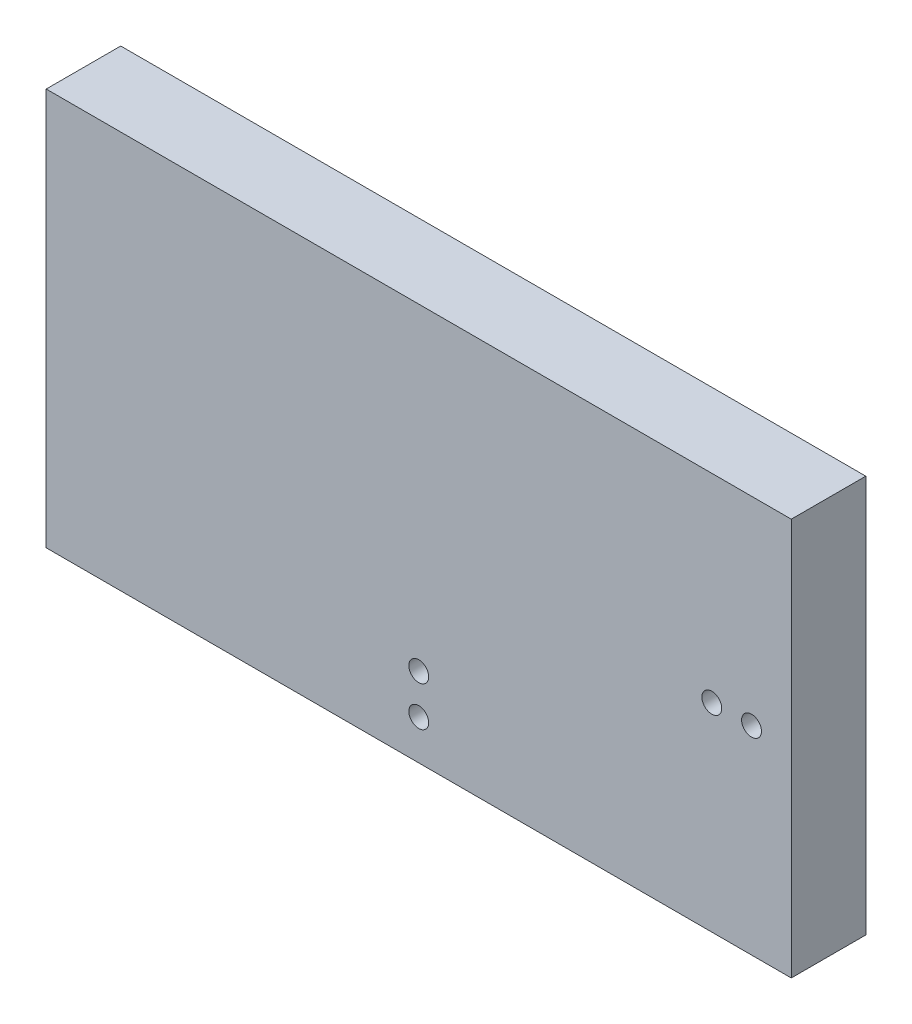
ISO-10303-21;
HEADER;
FILE_DESCRIPTION(('STEP AP214'),'2;1');
FILE_NAME('part.step','',(''),(''),'','','');
FILE_SCHEMA(('AUTOMOTIVE_DESIGN { 1 0 10303 214 1 1 1 1 }'));
ENDSEC;
DATA;
#1=APPLICATION_CONTEXT('core data for automotive mechanical design processes');
#2=APPLICATION_PROTOCOL_DEFINITION('international standard','automotive_design',2000,#1);
#3=PRODUCT_CONTEXT('',#1,'mechanical');
#4=PRODUCT('Part','Part','',(#3));
#5=PRODUCT_RELATED_PRODUCT_CATEGORY('part','',(#4));
#6=PRODUCT_DEFINITION_FORMATION('','',#4);
#7=PRODUCT_DEFINITION_CONTEXT('part definition',#1,'design');
#8=PRODUCT_DEFINITION('design','',#6,#7);
#9=PRODUCT_DEFINITION_SHAPE('','',#8);
#10=(LENGTH_UNIT() NAMED_UNIT(*) SI_UNIT(.MILLI.,.METRE.));
#11=(NAMED_UNIT(*) PLANE_ANGLE_UNIT() SI_UNIT($,.RADIAN.));
#12=(NAMED_UNIT(*) SI_UNIT($,.STERADIAN.) SOLID_ANGLE_UNIT());
#13=UNCERTAINTY_MEASURE_WITH_UNIT(LENGTH_MEASURE(1.E-05),#10,'distance_accuracy_value','');
#14=(GEOMETRIC_REPRESENTATION_CONTEXT(3) GLOBAL_UNCERTAINTY_ASSIGNED_CONTEXT((#13)) GLOBAL_UNIT_ASSIGNED_CONTEXT((#10,
#11,#12)) REPRESENTATION_CONTEXT('',''));
#15=CARTESIAN_POINT('',(0.,0.,0.));
#16=DIRECTION('',(0.,0.,1.));
#17=DIRECTION('',(1.,0.,0.));
#18=AXIS2_PLACEMENT_3D('',#15,#16,#17);
#19=CARTESIAN_POINT('',(-88.7336553866887,54.7225761772853,-15.));
#20=DIRECTION('',(-1.,0.,0.));
#21=DIRECTION('',(0.,0.,1.));
#22=AXIS2_PLACEMENT_3D('',#19,#20,#21);
#23=PLANE('',#22);
#24=DIRECTION('',(0.,-1.,0.));
#25=VECTOR('',#24,1.);
#26=CARTESIAN_POINT('',(-88.7336553866887,54.7225761772853,0.));
#27=LINE('',#26,#25);
#28=CARTESIAN_POINT('',(-88.7336553866887,54.7225761772853,0.));
#29=VERTEX_POINT('',#28);
#30=CARTESIAN_POINT('',(-88.7336553866887,-25.2774238227147,0.));
#31=VERTEX_POINT('',#30);
#32=EDGE_CURVE('E96',#29,#31,#27,.T.);
#33=ORIENTED_EDGE('',*,*,#32,.F.);
#34=DIRECTION('',(0.,0.,1.));
#35=VECTOR('',#34,1.);
#36=CARTESIAN_POINT('',(-88.7336553866887,54.7225761772853,-15.));
#37=LINE('',#36,#35);
#38=CARTESIAN_POINT('',(-88.7336553866887,54.7225761772853,-15.));
#39=VERTEX_POINT('',#38);
#40=EDGE_CURVE('E11',#39,#29,#37,.T.);
#41=ORIENTED_EDGE('',*,*,#40,.F.);
#42=DIRECTION('',(0.,-1.,0.));
#43=VECTOR('',#42,1.);
#44=CARTESIAN_POINT('',(-88.7336553866887,54.7225761772853,-15.));
#45=LINE('',#44,#43);
#46=CARTESIAN_POINT('',(-88.7336553866887,-25.2774238227147,-15.));
#47=VERTEX_POINT('',#46);
#48=EDGE_CURVE('E89',#39,#47,#45,.T.);
#49=ORIENTED_EDGE('',*,*,#48,.T.);
#50=DIRECTION('',(0.,0.,1.));
#51=VECTOR('',#50,1.);
#52=CARTESIAN_POINT('',(-88.7336553866887,-25.2774238227147,-15.));
#53=LINE('',#52,#51);
#54=EDGE_CURVE('E34',#47,#31,#53,.T.);
#55=ORIENTED_EDGE('',*,*,#54,.T.);
#56=EDGE_LOOP('',(#33,#41,#49,#55));
#57=FACE_BOUND('',#56,.T.);
#58=ADVANCED_FACE('F31',(#57),#23,.T.);
#59=CARTESIAN_POINT('',(-88.7336553866887,54.7225761772853,-15.));
#60=DIRECTION('',(0.,1.,0.));
#61=DIRECTION('',(0.,0.,1.));
#62=AXIS2_PLACEMENT_3D('',#59,#60,#61);
#63=PLANE('',#62);
#64=DIRECTION('',(-1.,0.,0.));
#65=VECTOR('',#64,1.);
#66=CARTESIAN_POINT('',(-88.7336553866887,54.7225761772853,0.));
#67=LINE('',#66,#65);
#68=CARTESIAN_POINT('',(61.2663446133113,54.7225761772853,0.));
#69=VERTEX_POINT('',#68);
#70=EDGE_CURVE('E91',#69,#29,#67,.T.);
#71=ORIENTED_EDGE('',*,*,#70,.F.);
#72=DIRECTION('',(0.,0.,1.));
#73=VECTOR('',#72,1.);
#74=CARTESIAN_POINT('',(61.2663446133113,54.7225761772853,-15.));
#75=LINE('',#74,#73);
#76=CARTESIAN_POINT('',(61.2663446133113,54.7225761772853,-15.));
#77=VERTEX_POINT('',#76);
#78=EDGE_CURVE('E40',#77,#69,#75,.T.);
#79=ORIENTED_EDGE('',*,*,#78,.F.);
#80=DIRECTION('',(-1.,0.,0.));
#81=VECTOR('',#80,1.);
#82=CARTESIAN_POINT('',(-88.7336553866887,54.7225761772853,-15.));
#83=LINE('',#82,#81);
#84=EDGE_CURVE('E86',#77,#39,#83,.T.);
#85=ORIENTED_EDGE('',*,*,#84,.T.);
#86=ORIENTED_EDGE('',*,*,#40,.T.);
#87=EDGE_LOOP('',(#71,#79,#85,#86));
#88=FACE_BOUND('',#87,.T.);
#89=ADVANCED_FACE('F107',(#88),#63,.T.);
#90=CARTESIAN_POINT('',(61.2663446133113,54.7225761772853,-15.));
#91=DIRECTION('',(1.,0.,0.));
#92=DIRECTION('',(0.,0.,-1.));
#93=AXIS2_PLACEMENT_3D('',#90,#91,#92);
#94=PLANE('',#93);
#95=DIRECTION('',(0.,1.,0.));
#96=VECTOR('',#95,1.);
#97=CARTESIAN_POINT('',(61.2663446133113,54.7225761772853,0.));
#98=LINE('',#97,#96);
#99=CARTESIAN_POINT('',(61.2663446133113,-25.2774238227147,0.));
#100=VERTEX_POINT('',#99);
#101=EDGE_CURVE('E81',#100,#69,#98,.T.);
#102=ORIENTED_EDGE('',*,*,#101,.F.);
#103=DIRECTION('',(0.,0.,1.));
#104=VECTOR('',#103,1.);
#105=CARTESIAN_POINT('',(61.2663446133113,-25.2774238227147,-15.));
#106=LINE('',#105,#104);
#107=CARTESIAN_POINT('',(61.2663446133113,-25.2774238227147,-15.));
#108=VERTEX_POINT('',#107);
#109=EDGE_CURVE('E76',#108,#100,#106,.T.);
#110=ORIENTED_EDGE('',*,*,#109,.F.);
#111=DIRECTION('',(0.,1.,0.));
#112=VECTOR('',#111,1.);
#113=CARTESIAN_POINT('',(61.2663446133113,54.7225761772853,-15.));
#114=LINE('',#113,#112);
#115=EDGE_CURVE('E79',#108,#77,#114,.T.);
#116=ORIENTED_EDGE('',*,*,#115,.T.);
#117=ORIENTED_EDGE('',*,*,#78,.T.);
#118=EDGE_LOOP('',(#102,#110,#116,#117));
#119=FACE_BOUND('',#118,.T.);
#120=ADVANCED_FACE('F78',(#119),#94,.T.);
#121=CARTESIAN_POINT('',(-88.7336553866887,-25.2774238227147,-15.));
#122=DIRECTION('',(0.,-1.,0.));
#123=DIRECTION('',(0.,0.,-1.));
#124=AXIS2_PLACEMENT_3D('',#121,#122,#123);
#125=PLANE('',#124);
#126=DIRECTION('',(1.,0.,0.));
#127=VECTOR('',#126,1.);
#128=CARTESIAN_POINT('',(-88.7336553866887,-25.2774238227147,0.));
#129=LINE('',#128,#127);
#130=EDGE_CURVE('E99',#31,#100,#129,.T.);
#131=ORIENTED_EDGE('',*,*,#130,.F.);
#132=ORIENTED_EDGE('',*,*,#54,.F.);
#133=DIRECTION('',(1.,0.,0.));
#134=VECTOR('',#133,1.);
#135=CARTESIAN_POINT('',(-88.7336553866887,-25.2774238227147,-15.));
#136=LINE('',#135,#134);
#137=EDGE_CURVE('E85',#47,#108,#136,.T.);
#138=ORIENTED_EDGE('',*,*,#137,.T.);
#139=ORIENTED_EDGE('',*,*,#109,.T.);
#140=EDGE_LOOP('',(#131,#132,#138,#139));
#141=FACE_BOUND('',#140,.T.);
#142=ADVANCED_FACE('F88',(#141),#125,.T.);
#143=CARTESIAN_POINT('',(-88.7336553866887,-25.2774238227147,-15.));
#144=DIRECTION('',(0.,0.,1.));
#145=DIRECTION('',(1.,0.,0.));
#146=AXIS2_PLACEMENT_3D('',#143,#144,#145);
#147=PLANE('',#146);
#148=ORIENTED_EDGE('',*,*,#48,.F.);
#149=ORIENTED_EDGE('',*,*,#84,.F.);
#150=ORIENTED_EDGE('',*,*,#115,.F.);
#151=ORIENTED_EDGE('',*,*,#137,.F.);
#152=EDGE_LOOP('',(#148,#149,#150,#151));
#153=FACE_BOUND('',#152,.T.);
#154=ADVANCED_FACE('F84',(#153),#147,.F.);
#155=CARTESIAN_POINT('',(-88.7336553866887,-25.2774238227147,0.));
#156=DIRECTION('',(0.,0.,1.));
#157=DIRECTION('',(1.,0.,0.));
#158=AXIS2_PLACEMENT_3D('',#155,#156,#157);
#159=PLANE('',#158);
#160=CARTESIAN_POINT('',(45.2663446133113,14.7225761772853,0.));
#161=DIRECTION('',(0.,0.,1.));
#162=DIRECTION('',(1.,0.,0.));
#163=AXIS2_PLACEMENT_3D('',#160,#161,#162);
#164=CIRCLE('',#163,2.);
#165=CARTESIAN_POINT('',(47.2663446133113,14.7225761772853,0.));
#166=VERTEX_POINT('',#165);
#167=EDGE_CURVE('E163',#166,#166,#164,.T.);
#168=ORIENTED_EDGE('',*,*,#167,.F.);
#169=EDGE_LOOP('',(#168));
#170=FACE_BOUND('',#169,.T.);
#171=CARTESIAN_POINT('',(53.2663446133113,14.7225761772853,0.));
#172=DIRECTION('',(0.,0.,1.));
#173=DIRECTION('',(1.,0.,0.));
#174=AXIS2_PLACEMENT_3D('',#171,#172,#173);
#175=CIRCLE('',#174,2.);
#176=CARTESIAN_POINT('',(55.2663446133113,14.7225761772853,0.));
#177=VERTEX_POINT('',#176);
#178=EDGE_CURVE('E162',#177,#177,#175,.T.);
#179=ORIENTED_EDGE('',*,*,#178,.F.);
#180=EDGE_LOOP('',(#179));
#181=FACE_BOUND('',#180,.T.);
#182=CARTESIAN_POINT('',(-13.7336553866887,-9.27742382271468,0.));
#183=DIRECTION('',(0.,0.,1.));
#184=DIRECTION('',(1.,0.,0.));
#185=AXIS2_PLACEMENT_3D('',#182,#183,#184);
#186=CIRCLE('',#185,2.);
#187=CARTESIAN_POINT('',(-11.7336553866887,-9.27742382271468,0.));
#188=VERTEX_POINT('',#187);
#189=EDGE_CURVE('E172',#188,#188,#186,.T.);
#190=ORIENTED_EDGE('',*,*,#189,.F.);
#191=EDGE_LOOP('',(#190));
#192=FACE_BOUND('',#191,.T.);
#193=CARTESIAN_POINT('',(-13.7336553866887,-17.2774238227147,0.));
#194=DIRECTION('',(0.,0.,1.));
#195=DIRECTION('',(1.,0.,0.));
#196=AXIS2_PLACEMENT_3D('',#193,#194,#195);
#197=CIRCLE('',#196,1.99758356197895);
#198=CARTESIAN_POINT('',(-11.7360718247097,-17.2774238227147,0.));
#199=VERTEX_POINT('',#198);
#200=EDGE_CURVE('E177',#199,#199,#197,.T.);
#201=ORIENTED_EDGE('',*,*,#200,.F.);
#202=EDGE_LOOP('',(#201));
#203=FACE_BOUND('',#202,.T.);
#204=ORIENTED_EDGE('',*,*,#32,.T.);
#205=ORIENTED_EDGE('',*,*,#130,.T.);
#206=ORIENTED_EDGE('',*,*,#101,.T.);
#207=ORIENTED_EDGE('',*,*,#70,.T.);
#208=EDGE_LOOP('',(#204,#205,#206,#207));
#209=FACE_BOUND('',#208,.T.);
#210=ADVANCED_FACE('F106',(#170,#181,#192,#203,#209),#159,.T.);
#211=CARTESIAN_POINT('',(-13.7336553866887,-17.2774238227147,-10.));
#212=DIRECTION('',(0.,0.,1.));
#213=DIRECTION('',(1.,0.,0.));
#214=AXIS2_PLACEMENT_3D('',#211,#212,#213);
#215=CYLINDRICAL_SURFACE('',#214,1.99758356197895);
#216=CARTESIAN_POINT('',(-13.7336553866887,-17.2774238227147,-10.));
#217=DIRECTION('',(0.,0.,1.));
#218=DIRECTION('',(1.,0.,0.));
#219=AXIS2_PLACEMENT_3D('',#216,#217,#218);
#220=CIRCLE('',#219,1.99758356197895);
#221=CARTESIAN_POINT('',(-11.7360718247097,-17.2774238227147,-10.));
#222=VERTEX_POINT('',#221);
#223=EDGE_CURVE('E100',#222,#222,#220,.T.);
#224=ORIENTED_EDGE('',*,*,#223,.F.);
#225=EDGE_LOOP('',(#224));
#226=FACE_BOUND('',#225,.T.);
#227=ORIENTED_EDGE('',*,*,#200,.T.);
#228=EDGE_LOOP('',(#227));
#229=FACE_BOUND('',#228,.T.);
#230=ADVANCED_FACE('F124',(#226,#229),#215,.F.);
#231=CARTESIAN_POINT('',(-13.7336553866887,-17.2774238227147,-10.));
#232=DIRECTION('',(0.,0.,1.));
#233=DIRECTION('',(1.,0.,0.));
#234=AXIS2_PLACEMENT_3D('',#231,#232,#233);
#235=PLANE('',#234);
#236=ORIENTED_EDGE('',*,*,#223,.T.);
#237=EDGE_LOOP('',(#236));
#238=FACE_BOUND('',#237,.T.);
#239=ADVANCED_FACE('F129',(#238),#235,.T.);
#240=CARTESIAN_POINT('',(-13.7336553866887,-9.27742382271468,-10.));
#241=DIRECTION('',(0.,0.,1.));
#242=DIRECTION('',(1.,0.,0.));
#243=AXIS2_PLACEMENT_3D('',#240,#241,#242);
#244=CYLINDRICAL_SURFACE('',#243,2.);
#245=CARTESIAN_POINT('',(-13.7336553866887,-9.27742382271468,-10.));
#246=DIRECTION('',(0.,0.,1.));
#247=DIRECTION('',(1.,0.,0.));
#248=AXIS2_PLACEMENT_3D('',#245,#246,#247);
#249=CIRCLE('',#248,2.);
#250=CARTESIAN_POINT('',(-11.7336553866887,-9.27742382271468,-10.));
#251=VERTEX_POINT('',#250);
#252=EDGE_CURVE('E174',#251,#251,#249,.T.);
#253=ORIENTED_EDGE('',*,*,#252,.F.);
#254=EDGE_LOOP('',(#253));
#255=FACE_BOUND('',#254,.T.);
#256=ORIENTED_EDGE('',*,*,#189,.T.);
#257=EDGE_LOOP('',(#256));
#258=FACE_BOUND('',#257,.T.);
#259=ADVANCED_FACE('F133',(#255,#258),#244,.F.);
#260=CARTESIAN_POINT('',(-13.7336553866887,-9.27742382271468,-10.));
#261=DIRECTION('',(0.,0.,1.));
#262=DIRECTION('',(1.,0.,0.));
#263=AXIS2_PLACEMENT_3D('',#260,#261,#262);
#264=PLANE('',#263);
#265=ORIENTED_EDGE('',*,*,#252,.T.);
#266=EDGE_LOOP('',(#265));
#267=FACE_BOUND('',#266,.T.);
#268=ADVANCED_FACE('F137',(#267),#264,.T.);
#269=CARTESIAN_POINT('',(53.2663446133113,14.7225761772853,-10.));
#270=DIRECTION('',(0.,0.,1.));
#271=DIRECTION('',(1.,0.,0.));
#272=AXIS2_PLACEMENT_3D('',#269,#270,#271);
#273=CYLINDRICAL_SURFACE('',#272,2.);
#274=CARTESIAN_POINT('',(53.2663446133113,14.7225761772853,-10.));
#275=DIRECTION('',(0.,0.,1.));
#276=DIRECTION('',(1.,0.,0.));
#277=AXIS2_PLACEMENT_3D('',#274,#275,#276);
#278=CIRCLE('',#277,2.);
#279=CARTESIAN_POINT('',(55.2663446133113,14.7225761772853,-10.));
#280=VERTEX_POINT('',#279);
#281=EDGE_CURVE('E166',#280,#280,#278,.T.);
#282=ORIENTED_EDGE('',*,*,#281,.F.);
#283=EDGE_LOOP('',(#282));
#284=FACE_BOUND('',#283,.T.);
#285=ORIENTED_EDGE('',*,*,#178,.T.);
#286=EDGE_LOOP('',(#285));
#287=FACE_BOUND('',#286,.T.);
#288=ADVANCED_FACE('F141',(#284,#287),#273,.F.);
#289=CARTESIAN_POINT('',(53.2663446133113,14.7225761772853,-10.));
#290=DIRECTION('',(0.,0.,1.));
#291=DIRECTION('',(1.,0.,0.));
#292=AXIS2_PLACEMENT_3D('',#289,#290,#291);
#293=PLANE('',#292);
#294=ORIENTED_EDGE('',*,*,#281,.T.);
#295=EDGE_LOOP('',(#294));
#296=FACE_BOUND('',#295,.T.);
#297=ADVANCED_FACE('F145',(#296),#293,.T.);
#298=CARTESIAN_POINT('',(45.2663446133113,14.7225761772853,-10.));
#299=DIRECTION('',(0.,0.,1.));
#300=DIRECTION('',(1.,0.,0.));
#301=AXIS2_PLACEMENT_3D('',#298,#299,#300);
#302=CYLINDRICAL_SURFACE('',#301,2.);
#303=CARTESIAN_POINT('',(45.2663446133113,14.7225761772853,-10.));
#304=DIRECTION('',(0.,0.,1.));
#305=DIRECTION('',(1.,0.,0.));
#306=AXIS2_PLACEMENT_3D('',#303,#304,#305);
#307=CIRCLE('',#306,2.);
#308=CARTESIAN_POINT('',(47.2663446133113,14.7225761772853,-10.));
#309=VERTEX_POINT('',#308);
#310=EDGE_CURVE('E161',#309,#309,#307,.T.);
#311=ORIENTED_EDGE('',*,*,#310,.F.);
#312=EDGE_LOOP('',(#311));
#313=FACE_BOUND('',#312,.T.);
#314=ORIENTED_EDGE('',*,*,#167,.T.);
#315=EDGE_LOOP('',(#314));
#316=FACE_BOUND('',#315,.T.);
#317=ADVANCED_FACE('F149',(#313,#316),#302,.F.);
#318=CARTESIAN_POINT('',(45.2663446133113,14.7225761772853,-10.));
#319=DIRECTION('',(0.,0.,1.));
#320=DIRECTION('',(1.,0.,0.));
#321=AXIS2_PLACEMENT_3D('',#318,#319,#320);
#322=PLANE('',#321);
#323=ORIENTED_EDGE('',*,*,#310,.T.);
#324=EDGE_LOOP('',(#323));
#325=FACE_BOUND('',#324,.T.);
#326=ADVANCED_FACE('F153',(#325),#322,.T.);
#327=CLOSED_SHELL('',(#58,#89,#120,#142,#154,#210,#230,#239,#259,#268,#288,#297,#317,#326));
#328=MANIFOLD_SOLID_BREP('B2',#327);
#329=ADVANCED_BREP_SHAPE_REPRESENTATION('',(#18,#328),#14);
#330=SHAPE_DEFINITION_REPRESENTATION(#9,#329);
ENDSEC;
END-ISO-10303-21;
